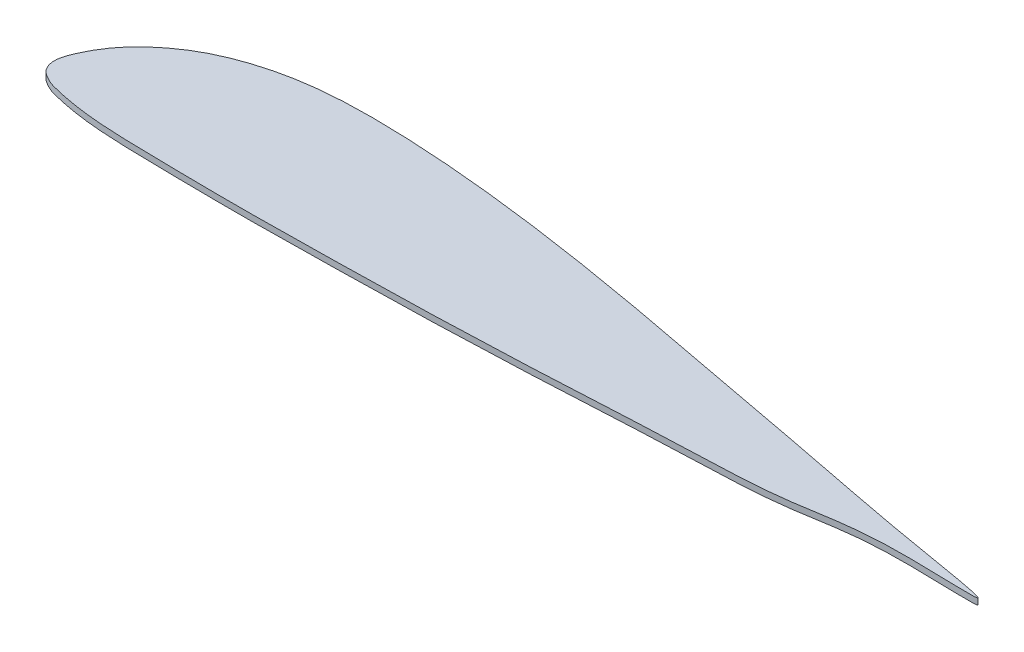
ISO-10303-21;
HEADER;
FILE_DESCRIPTION(('STEP AP214'),'2;1');
FILE_NAME('part.step','',(''),(''),'','','');
FILE_SCHEMA(('AUTOMOTIVE_DESIGN { 1 0 10303 214 1 1 1 1 }'));
ENDSEC;
DATA;
#1=APPLICATION_CONTEXT('core data for automotive mechanical design processes');
#2=APPLICATION_PROTOCOL_DEFINITION('international standard','automotive_design',2000,#1);
#3=PRODUCT_CONTEXT('',#1,'mechanical');
#4=PRODUCT('Part','Part','',(#3));
#5=PRODUCT_RELATED_PRODUCT_CATEGORY('part','',(#4));
#6=PRODUCT_DEFINITION_FORMATION('','',#4);
#7=PRODUCT_DEFINITION_CONTEXT('part definition',#1,'design');
#8=PRODUCT_DEFINITION('design','',#6,#7);
#9=PRODUCT_DEFINITION_SHAPE('','',#8);
#10=(LENGTH_UNIT() NAMED_UNIT(*) SI_UNIT(.MILLI.,.METRE.));
#11=(NAMED_UNIT(*) PLANE_ANGLE_UNIT() SI_UNIT($,.RADIAN.));
#12=(NAMED_UNIT(*) SI_UNIT($,.STERADIAN.) SOLID_ANGLE_UNIT());
#13=UNCERTAINTY_MEASURE_WITH_UNIT(LENGTH_MEASURE(1.E-05),#10,'distance_accuracy_value','');
#14=(GEOMETRIC_REPRESENTATION_CONTEXT(3) GLOBAL_UNCERTAINTY_ASSIGNED_CONTEXT((#13)) GLOBAL_UNIT_ASSIGNED_CONTEXT((#10,
#11,#12)) REPRESENTATION_CONTEXT('',''));
#15=CARTESIAN_POINT('',(0.,0.,0.));
#16=DIRECTION('',(0.,0.,1.));
#17=DIRECTION('',(1.,0.,0.));
#18=AXIS2_PLACEMENT_3D('',#15,#16,#17);
#19=CARTESIAN_POINT('',(-193.066121327171,2.34497004234652,16.9268651737976));
#20=CARTESIAN_POINT('',(-192.687147252382,2.34497004234652,19.2635656922565));
#21=CARTESIAN_POINT('',(-191.131632515452,2.34497004234652,22.8428127313799));
#22=CARTESIAN_POINT('',(-186.297605413992,2.34497004234652,26.246520564898));
#23=CARTESIAN_POINT('',(-181.301662878971,2.34497004234652,28.809278402833));
#24=CARTESIAN_POINT('',(-173.1156665939,2.34497004234652,30.8132586215114));
#25=CARTESIAN_POINT('',(-163.135271700319,2.34497004234652,32.8359823206273));
#26=CARTESIAN_POINT('',(-149.110762507208,2.34497004234652,34.6918416373929));
#27=CARTESIAN_POINT('',(-129.089892123525,2.34497004234652,36.0266704187891));
#28=CARTESIAN_POINT('',(-103.067762636958,2.34497004234652,36.4406195394018));
#29=CARTESIAN_POINT('',(-73.0675391409671,2.34497004234652,36.8351952332903));
#30=CARTESIAN_POINT('',(-43.0656674222984,2.34497004234652,36.9397172821758));
#31=CARTESIAN_POINT('',(-3.0591697638407,2.34497004234652,36.3361913226002));
#32=CARTESIAN_POINT('',(66.8997217180394,2.34497004234652,35.2747616337132));
#33=CARTESIAN_POINT('',(147.349443264231,2.34497004234652,32.0023104755008));
#34=CARTESIAN_POINT('',(226.272736439664,2.34497004234652,27.3547807712749));
#35=CARTESIAN_POINT('',(289.630842217434,2.34497004234652,26.0958820860369));
#36=CARTESIAN_POINT('',(337.439738303666,2.34497004234652,13.6822035117373));
#37=CARTESIAN_POINT('',(441.61403470486,2.34497004234652,20.8024582745415));
#38=CARTESIAN_POINT('',(337.476657325293,2.34497004234652,4.46392123443102));
#39=CARTESIAN_POINT('',(289.468922241348,2.34497004234652,-5.59323583108616));
#40=CARTESIAN_POINT('',(226.250925746285,2.34497004234652,-17.3297868673004));
#41=CARTESIAN_POINT('',(167.165865526624,2.34497004234652,-28.7196365315417));
#42=CARTESIAN_POINT('',(107.034307271698,2.34497004234652,-39.7659037364629));
#43=CARTESIAN_POINT('',(47.1297605208215,2.34497004234652,-48.9172837679459));
#44=CARTESIAN_POINT('',(-2.97746705483742,2.34497004234652,-54.2188382128144));
#45=CARTESIAN_POINT('',(-43.0437237818277,2.34497004234652,-56.385948229335));
#46=CARTESIAN_POINT('',(-73.118397271499,2.34497004234652,-56.6085448484759));
#47=CARTESIAN_POINT('',(-103.473960860562,2.34497004234652,-54.0622863990968));
#48=CARTESIAN_POINT('',(-129.749927884938,2.34497004234652,-47.3763036930078));
#49=CARTESIAN_POINT('',(-149.710033379442,2.34497004234652,-38.658744584117));
#50=CARTESIAN_POINT('',(-163.70126446097,2.34497004234652,-29.5185370228034));
#51=CARTESIAN_POINT('',(-173.702218274361,2.34497004234652,-20.8855470014712));
#52=CARTESIAN_POINT('',(-181.620657498212,2.34497004234652,-11.7805843678709));
#53=CARTESIAN_POINT('',(-186.523041235703,2.34497004234652,-4.17875268938036));
#54=CARTESIAN_POINT('',(-191.199495284596,2.34497004234652,5.22840375490839));
#55=CARTESIAN_POINT('',(-193.827208219847,2.34497004234652,12.2341110910896));
#56=CARTESIAN_POINT('',(-193.066121327171,2.34497004234652,16.9268651737976));
#57=B_SPLINE_CURVE_WITH_KNOTS('',3,(#19,#20,#21,#22,#23,#24,#25,#26,#27,#28,#29,#30,#31,#32,#33,
#34,#35,#36,#37,#38,#39,#40,#41,#42,#43,#44,#45,#46,#47,#48,#49,#50,#51,#52,#53,#54,#55,#56),
.UNSPECIFIED.,.T.,.F.,(4,1,1,1,1,1,1,1,1,1,1,1,1,1,1,1,1,1,1,1,1,1,1,1,1,1,1,1,1,1,1,1,1,1,1,4),
(0.,0.00564661209340078,0.00870170800772663,0.0140882843501977,0.0190914830663168,
0.0289181102200861,0.0386413206855738,0.0531338340120211,0.0772314766235468,0.101322712740751,
0.125412262655221,0.149503498772425,0.197690306609914,0.294121565972602,0.3423607556051,
0.390620728122172,0.439156926244479,0.487335929716111,0.536376854326232,0.585417778936353,
0.634458703546474,0.683499628156596,0.732452909824186,0.781170912081147,0.829599894216143,
0.853721942971072,0.877811444706587,0.902011696283677,0.926902109108912,0.942751829681664,
0.954244314694217,0.967048060494449,0.974426844357853,0.983273433040224,0.988660009382695,1.),.UNSPECIFIED.);
#58=DIRECTION('',(0.,-1.,0.));
#59=VECTOR('',#58,1.);
#60=SURFACE_OF_LINEAR_EXTRUSION('',#57,#59);
#61=CARTESIAN_POINT('',(-193.066121327171,2.34497004234652,16.9268651737976));
#62=VERTEX_POINT('',#61);
#63=EDGE_CURVE('E10',#62,#62,#57,.T.);
#64=ORIENTED_EDGE('',*,*,#63,.F.);
#65=EDGE_LOOP('',(#64));
#66=FACE_BOUND('',#65,.T.);
#67=CARTESIAN_POINT('',(-193.066121327171,-1.67502995765348,16.9268651737976));
#68=CARTESIAN_POINT('',(-192.687147252382,-1.67502995765348,19.2635656922565));
#69=CARTESIAN_POINT('',(-191.131632515452,-1.67502995765348,22.8428127313799));
#70=CARTESIAN_POINT('',(-186.297605413992,-1.67502995765348,26.246520564898));
#71=CARTESIAN_POINT('',(-181.301662878971,-1.67502995765348,28.809278402833));
#72=CARTESIAN_POINT('',(-173.1156665939,-1.67502995765348,30.8132586215114));
#73=CARTESIAN_POINT('',(-163.135271700319,-1.67502995765348,32.8359823206273));
#74=CARTESIAN_POINT('',(-149.110762507208,-1.67502995765348,34.6918416373929));
#75=CARTESIAN_POINT('',(-129.089892123525,-1.67502995765348,36.0266704187891));
#76=CARTESIAN_POINT('',(-103.067762636958,-1.67502995765348,36.4406195394018));
#77=CARTESIAN_POINT('',(-73.0675391409671,-1.67502995765348,36.8351952332903));
#78=CARTESIAN_POINT('',(-43.0656674222984,-1.67502995765348,36.9397172821758));
#79=CARTESIAN_POINT('',(-3.0591697638407,-1.67502995765348,36.3361913226002));
#80=CARTESIAN_POINT('',(66.8997217180394,-1.67502995765348,35.2747616337132));
#81=CARTESIAN_POINT('',(147.349443264231,-1.67502995765348,32.0023104755008));
#82=CARTESIAN_POINT('',(226.272736439664,-1.67502995765348,27.3547807712749));
#83=CARTESIAN_POINT('',(289.630842217434,-1.67502995765348,26.0958820860369));
#84=CARTESIAN_POINT('',(337.439738303666,-1.67502995765348,13.6822035117373));
#85=CARTESIAN_POINT('',(441.61403470486,-1.67502995765348,20.8024582745415));
#86=CARTESIAN_POINT('',(337.476657325293,-1.67502995765348,4.46392123443102));
#87=CARTESIAN_POINT('',(289.468922241348,-1.67502995765348,-5.59323583108616));
#88=CARTESIAN_POINT('',(226.250925746285,-1.67502995765348,-17.3297868673004));
#89=CARTESIAN_POINT('',(167.165865526624,-1.67502995765348,-28.7196365315417));
#90=CARTESIAN_POINT('',(107.034307271698,-1.67502995765348,-39.7659037364629));
#91=CARTESIAN_POINT('',(47.1297605208215,-1.67502995765348,-48.9172837679459));
#92=CARTESIAN_POINT('',(-2.97746705483742,-1.67502995765348,-54.2188382128144));
#93=CARTESIAN_POINT('',(-43.0437237818277,-1.67502995765348,-56.385948229335));
#94=CARTESIAN_POINT('',(-73.118397271499,-1.67502995765348,-56.6085448484759));
#95=CARTESIAN_POINT('',(-103.473960860562,-1.67502995765348,-54.0622863990968));
#96=CARTESIAN_POINT('',(-129.749927884938,-1.67502995765348,-47.3763036930078));
#97=CARTESIAN_POINT('',(-149.710033379442,-1.67502995765348,-38.658744584117));
#98=CARTESIAN_POINT('',(-163.70126446097,-1.67502995765348,-29.5185370228034));
#99=CARTESIAN_POINT('',(-173.702218274361,-1.67502995765348,-20.8855470014712));
#100=CARTESIAN_POINT('',(-181.620657498212,-1.67502995765348,-11.7805843678709));
#101=CARTESIAN_POINT('',(-186.523041235703,-1.67502995765348,-4.17875268938036));
#102=CARTESIAN_POINT('',(-191.199495284596,-1.67502995765348,5.22840375490839));
#103=CARTESIAN_POINT('',(-193.827208219847,-1.67502995765348,12.2341110910896));
#104=CARTESIAN_POINT('',(-193.066121327171,-1.67502995765348,16.9268651737976));
#105=B_SPLINE_CURVE_WITH_KNOTS('',3,(#67,#68,#69,#70,#71,#72,#73,#74,#75,#76,#77,#78,#79,#80,
#81,#82,#83,#84,#85,#86,#87,#88,#89,#90,#91,#92,#93,#94,#95,#96,#97,#98,#99,#100,#101,#102,#103,
#104),.UNSPECIFIED.,.T.,.F.,(4,1,1,1,1,1,1,1,1,1,1,1,1,1,1,1,1,1,1,1,1,1,1,1,1,1,1,1,1,1,1,1,1,
1,1,4),(0.,0.00564661209340078,0.00870170800772663,0.0140882843501977,0.0190914830663168,
0.0289181102200861,0.0386413206855738,0.0531338340120211,0.0772314766235468,0.101322712740751,
0.125412262655221,0.149503498772425,0.197690306609914,0.294121565972602,0.3423607556051,
0.390620728122172,0.439156926244479,0.487335929716111,0.536376854326232,0.585417778936353,
0.634458703546474,0.683499628156596,0.732452909824186,0.781170912081147,0.829599894216143,
0.853721942971072,0.877811444706587,0.902011696283677,0.926902109108912,0.942751829681664,
0.954244314694217,0.967048060494449,0.974426844357853,0.983273433040224,0.988660009382695,1.),.UNSPECIFIED.);
#106=CARTESIAN_POINT('',(-193.066121327171,-1.67502995765348,16.9268651737976));
#107=VERTEX_POINT('',#106);
#108=EDGE_CURVE('E37',#107,#107,#105,.T.);
#109=ORIENTED_EDGE('',*,*,#108,.T.);
#110=EDGE_LOOP('',(#109));
#111=FACE_BOUND('',#110,.T.);
#112=ADVANCED_FACE('F33',(#66,#111),#60,.F.);
#113=CARTESIAN_POINT('',(400.935707312868,2.34497004234652,15.0519590556477));
#114=DIRECTION('',(0.,1.,0.));
#115=DIRECTION('',(0.,0.,1.));
#116=AXIS2_PLACEMENT_3D('',#113,#114,#115);
#117=PLANE('',#116);
#118=ORIENTED_EDGE('',*,*,#63,.T.);
#119=EDGE_LOOP('',(#118));
#120=FACE_BOUND('',#119,.T.);
#121=ADVANCED_FACE('F56',(#120),#117,.T.);
#122=CARTESIAN_POINT('',(400.935707312868,-1.67502995765348,15.0519590556477));
#123=DIRECTION('',(0.,1.,0.));
#124=DIRECTION('',(0.,0.,1.));
#125=AXIS2_PLACEMENT_3D('',#122,#123,#124);
#126=PLANE('',#125);
#127=ORIENTED_EDGE('',*,*,#108,.F.);
#128=EDGE_LOOP('',(#127));
#129=FACE_BOUND('',#128,.T.);
#130=ADVANCED_FACE('F54',(#129),#126,.F.);
#131=CLOSED_SHELL('',(#112,#121,#130));
#132=MANIFOLD_SOLID_BREP('B2',#131);
#133=ADVANCED_BREP_SHAPE_REPRESENTATION('',(#18,#132),#14);
#134=SHAPE_DEFINITION_REPRESENTATION(#9,#133);
ENDSEC;
END-ISO-10303-21;
